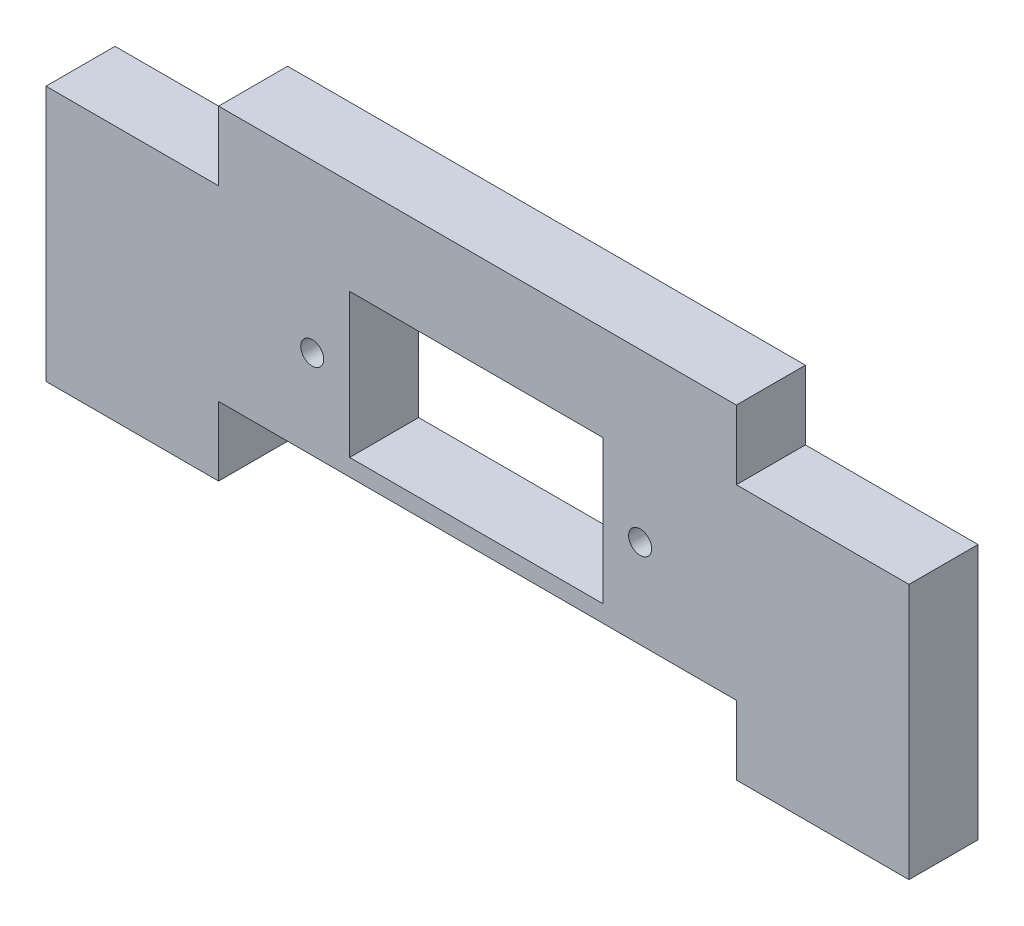
ISO-10303-21;
HEADER;
FILE_DESCRIPTION(('STEP AP214'),'2;1');
FILE_NAME('part.step','',(''),(''),'','','');
FILE_SCHEMA(('AUTOMOTIVE_DESIGN { 1 0 10303 214 1 1 1 1 }'));
ENDSEC;
DATA;
#1=APPLICATION_CONTEXT('core data for automotive mechanical design processes');
#2=APPLICATION_PROTOCOL_DEFINITION('international standard','automotive_design',2000,#1);
#3=PRODUCT_CONTEXT('',#1,'mechanical');
#4=PRODUCT('Part','Part','',(#3));
#5=PRODUCT_RELATED_PRODUCT_CATEGORY('part','',(#4));
#6=PRODUCT_DEFINITION_FORMATION('','',#4);
#7=PRODUCT_DEFINITION_CONTEXT('part definition',#1,'design');
#8=PRODUCT_DEFINITION('design','',#6,#7);
#9=PRODUCT_DEFINITION_SHAPE('','',#8);
#10=(LENGTH_UNIT() NAMED_UNIT(*) SI_UNIT(.MILLI.,.METRE.));
#11=(NAMED_UNIT(*) PLANE_ANGLE_UNIT() SI_UNIT($,.RADIAN.));
#12=(NAMED_UNIT(*) SI_UNIT($,.STERADIAN.) SOLID_ANGLE_UNIT());
#13=UNCERTAINTY_MEASURE_WITH_UNIT(LENGTH_MEASURE(1.E-05),#10,'distance_accuracy_value','');
#14=(GEOMETRIC_REPRESENTATION_CONTEXT(3) GLOBAL_UNCERTAINTY_ASSIGNED_CONTEXT((#13)) GLOBAL_UNIT_ASSIGNED_CONTEXT((#10,
#11,#12)) REPRESENTATION_CONTEXT('',''));
#15=CARTESIAN_POINT('',(0.,0.,0.));
#16=DIRECTION('',(0.,0.,1.));
#17=DIRECTION('',(1.,0.,0.));
#18=AXIS2_PLACEMENT_3D('',#15,#16,#17);
#19=CARTESIAN_POINT('',(-52.2574738828129,114.914823412849,220.248004760979));
#20=DIRECTION('',(0.,1.,0.));
#21=DIRECTION('',(0.,0.,1.));
#22=AXIS2_PLACEMENT_3D('',#19,#20,#21);
#23=PLANE('',#22);
#24=DIRECTION('',(-1.,0.,0.));
#25=VECTOR('',#24,1.);
#26=CARTESIAN_POINT('',(-52.2574738828129,114.914823412849,232.248004760979));
#27=LINE('',#26,#25);
#28=CARTESIAN_POINT('',(-52.2574738828129,114.914823412849,232.248004760979));
#29=VERTEX_POINT('',#28);
#30=CARTESIAN_POINT('',(-82.2574738828129,114.914823412849,232.248004760979));
#31=VERTEX_POINT('',#30);
#32=EDGE_CURVE('E182',#29,#31,#27,.T.);
#33=ORIENTED_EDGE('',*,*,#32,.F.);
#34=DIRECTION('',(0.,0.,1.));
#35=VECTOR('',#34,1.);
#36=CARTESIAN_POINT('',(-52.2574738828129,114.914823412849,220.248004760979));
#37=LINE('',#36,#35);
#38=CARTESIAN_POINT('',(-52.2574738828129,114.914823412849,220.248004760979));
#39=VERTEX_POINT('',#38);
#40=EDGE_CURVE('E11',#39,#29,#37,.T.);
#41=ORIENTED_EDGE('',*,*,#40,.F.);
#42=DIRECTION('',(-1.,0.,0.));
#43=VECTOR('',#42,1.);
#44=CARTESIAN_POINT('',(-52.2574738828129,114.914823412849,220.248004760979));
#45=LINE('',#44,#43);
#46=CARTESIAN_POINT('',(-82.2574738828129,114.914823412849,220.248004760979));
#47=VERTEX_POINT('',#46);
#48=EDGE_CURVE('E186',#39,#47,#45,.T.);
#49=ORIENTED_EDGE('',*,*,#48,.T.);
#50=DIRECTION('',(0.,0.,1.));
#51=VECTOR('',#50,1.);
#52=CARTESIAN_POINT('',(-82.2574738828129,114.914823412849,220.248004760979));
#53=LINE('',#52,#51);
#54=EDGE_CURVE('E220',#47,#31,#53,.T.);
#55=ORIENTED_EDGE('',*,*,#54,.T.);
#56=EDGE_LOOP('',(#33,#41,#49,#55));
#57=FACE_BOUND('',#56,.T.);
#58=ADVANCED_FACE('F33',(#57),#23,.T.);
#59=CARTESIAN_POINT('',(-52.2574738828129,126.914823412849,220.248004760979));
#60=DIRECTION('',(-1.,0.,0.));
#61=DIRECTION('',(0.,0.,1.));
#62=AXIS2_PLACEMENT_3D('',#59,#60,#61);
#63=PLANE('',#62);
#64=DIRECTION('',(0.,-1.,0.));
#65=VECTOR('',#64,1.);
#66=CARTESIAN_POINT('',(-52.2574738828129,126.914823412849,232.248004760979));
#67=LINE('',#66,#65);
#68=CARTESIAN_POINT('',(-52.2574738828129,126.914823412849,232.248004760979));
#69=VERTEX_POINT('',#68);
#70=EDGE_CURVE('E190',#69,#29,#67,.T.);
#71=ORIENTED_EDGE('',*,*,#70,.F.);
#72=DIRECTION('',(0.,0.,1.));
#73=VECTOR('',#72,1.);
#74=CARTESIAN_POINT('',(-52.2574738828129,126.914823412849,220.248004760979));
#75=LINE('',#74,#73);
#76=CARTESIAN_POINT('',(-52.2574738828129,126.914823412849,220.248004760979));
#77=VERTEX_POINT('',#76);
#78=EDGE_CURVE('E41',#77,#69,#75,.T.);
#79=ORIENTED_EDGE('',*,*,#78,.F.);
#80=DIRECTION('',(0.,-1.,0.));
#81=VECTOR('',#80,1.);
#82=CARTESIAN_POINT('',(-52.2574738828129,126.914823412849,220.248004760979));
#83=LINE('',#82,#81);
#84=EDGE_CURVE('E217',#77,#39,#83,.T.);
#85=ORIENTED_EDGE('',*,*,#84,.T.);
#86=ORIENTED_EDGE('',*,*,#40,.T.);
#87=EDGE_LOOP('',(#71,#79,#85,#86));
#88=FACE_BOUND('',#87,.T.);
#89=ADVANCED_FACE('F286',(#88),#63,.T.);
#90=CARTESIAN_POINT('',(-52.2574738828129,126.914823412849,220.248004760979));
#91=DIRECTION('',(0.,1.,0.));
#92=DIRECTION('',(0.,0.,1.));
#93=AXIS2_PLACEMENT_3D('',#90,#91,#92);
#94=PLANE('',#93);
#95=DIRECTION('',(-1.,0.,0.));
#96=VECTOR('',#95,1.);
#97=CARTESIAN_POINT('',(-52.2574738828129,126.914823412849,232.248004760979));
#98=LINE('',#97,#96);
#99=CARTESIAN_POINT('',(37.7425261171871,126.914823412849,232.248004760979));
#100=VERTEX_POINT('',#99);
#101=EDGE_CURVE('E250',#100,#69,#98,.T.);
#102=ORIENTED_EDGE('',*,*,#101,.F.);
#103=DIRECTION('',(0.,0.,1.));
#104=VECTOR('',#103,1.);
#105=CARTESIAN_POINT('',(37.7425261171871,126.914823412849,220.248004760979));
#106=LINE('',#105,#104);
#107=CARTESIAN_POINT('',(37.7425261171871,126.914823412849,220.248004760979));
#108=VERTEX_POINT('',#107);
#109=EDGE_CURVE('E256',#108,#100,#106,.T.);
#110=ORIENTED_EDGE('',*,*,#109,.F.);
#111=DIRECTION('',(-1.,0.,0.));
#112=VECTOR('',#111,1.);
#113=CARTESIAN_POINT('',(-52.2574738828129,126.914823412849,220.248004760979));
#114=LINE('',#113,#112);
#115=EDGE_CURVE('E214',#108,#77,#114,.T.);
#116=ORIENTED_EDGE('',*,*,#115,.T.);
#117=ORIENTED_EDGE('',*,*,#78,.T.);
#118=EDGE_LOOP('',(#102,#110,#116,#117));
#119=FACE_BOUND('',#118,.T.);
#120=ADVANCED_FACE('F324',(#119),#94,.T.);
#121=CARTESIAN_POINT('',(37.7425261171871,126.914823412849,220.248004760979));
#122=DIRECTION('',(1.,0.,0.));
#123=DIRECTION('',(0.,0.,-1.));
#124=AXIS2_PLACEMENT_3D('',#121,#122,#123);
#125=PLANE('',#124);
#126=DIRECTION('',(0.,1.,0.));
#127=VECTOR('',#126,1.);
#128=CARTESIAN_POINT('',(37.7425261171871,126.914823412849,232.248004760979));
#129=LINE('',#128,#127);
#130=CARTESIAN_POINT('',(37.7425261171871,114.914823412849,232.248004760979));
#131=VERTEX_POINT('',#130);
#132=EDGE_CURVE('E247',#131,#100,#129,.T.);
#133=ORIENTED_EDGE('',*,*,#132,.F.);
#134=DIRECTION('',(0.,0.,1.));
#135=VECTOR('',#134,1.);
#136=CARTESIAN_POINT('',(37.7425261171871,114.914823412849,220.248004760979));
#137=LINE('',#136,#135);
#138=CARTESIAN_POINT('',(37.7425261171871,114.914823412849,220.248004760979));
#139=VERTEX_POINT('',#138);
#140=EDGE_CURVE('E258',#139,#131,#137,.T.);
#141=ORIENTED_EDGE('',*,*,#140,.F.);
#142=DIRECTION('',(0.,1.,0.));
#143=VECTOR('',#142,1.);
#144=CARTESIAN_POINT('',(37.7425261171871,126.914823412849,220.248004760979));
#145=LINE('',#144,#143);
#146=EDGE_CURVE('E211',#139,#108,#145,.T.);
#147=ORIENTED_EDGE('',*,*,#146,.T.);
#148=ORIENTED_EDGE('',*,*,#109,.T.);
#149=EDGE_LOOP('',(#133,#141,#147,#148));
#150=FACE_BOUND('',#149,.T.);
#151=ADVANCED_FACE('F322',(#150),#125,.T.);
#152=CARTESIAN_POINT('',(37.7425261171871,114.914823412849,220.248004760979));
#153=DIRECTION('',(0.,1.,0.));
#154=DIRECTION('',(0.,0.,1.));
#155=AXIS2_PLACEMENT_3D('',#152,#153,#154);
#156=PLANE('',#155);
#157=DIRECTION('',(-1.,0.,0.));
#158=VECTOR('',#157,1.);
#159=CARTESIAN_POINT('',(37.7425261171871,114.914823412849,232.248004760979));
#160=LINE('',#159,#158);
#161=CARTESIAN_POINT('',(67.7425261171871,114.914823412849,232.248004760979));
#162=VERTEX_POINT('',#161);
#163=EDGE_CURVE('E244',#162,#131,#160,.T.);
#164=ORIENTED_EDGE('',*,*,#163,.F.);
#165=DIRECTION('',(0.,0.,1.));
#166=VECTOR('',#165,1.);
#167=CARTESIAN_POINT('',(67.7425261171871,114.914823412849,220.248004760979));
#168=LINE('',#167,#166);
#169=CARTESIAN_POINT('',(67.7425261171871,114.914823412849,220.248004760979));
#170=VERTEX_POINT('',#169);
#171=EDGE_CURVE('E260',#170,#162,#168,.T.);
#172=ORIENTED_EDGE('',*,*,#171,.F.);
#173=DIRECTION('',(-1.,0.,0.));
#174=VECTOR('',#173,1.);
#175=CARTESIAN_POINT('',(37.7425261171871,114.914823412849,220.248004760979));
#176=LINE('',#175,#174);
#177=EDGE_CURVE('E208',#170,#139,#176,.T.);
#178=ORIENTED_EDGE('',*,*,#177,.T.);
#179=ORIENTED_EDGE('',*,*,#140,.T.);
#180=EDGE_LOOP('',(#164,#172,#178,#179));
#181=FACE_BOUND('',#180,.T.);
#182=ADVANCED_FACE('F319',(#181),#156,.T.);
#183=CARTESIAN_POINT('',(67.7425261171871,114.914823412849,220.248004760979));
#184=DIRECTION('',(1.,0.,0.));
#185=DIRECTION('',(0.,1.,0.));
#186=AXIS2_PLACEMENT_3D('',#183,#184,#185);
#187=PLANE('',#186);
#188=DIRECTION('',(0.,1.,0.));
#189=VECTOR('',#188,1.);
#190=CARTESIAN_POINT('',(67.7425261171871,114.914823412849,232.248004760979));
#191=LINE('',#190,#189);
#192=CARTESIAN_POINT('',(67.7425261171871,70.4648234128495,232.248004760979));
#193=VERTEX_POINT('',#192);
#194=EDGE_CURVE('E241',#193,#162,#191,.T.);
#195=ORIENTED_EDGE('',*,*,#194,.F.);
#196=DIRECTION('',(0.,0.,1.));
#197=VECTOR('',#196,1.);
#198=CARTESIAN_POINT('',(67.7425261171871,70.4648234128495,220.248004760979));
#199=LINE('',#198,#197);
#200=CARTESIAN_POINT('',(67.7425261171871,70.4648234128495,220.248004760979));
#201=VERTEX_POINT('',#200);
#202=EDGE_CURVE('E262',#201,#193,#199,.T.);
#203=ORIENTED_EDGE('',*,*,#202,.F.);
#204=DIRECTION('',(0.,1.,0.));
#205=VECTOR('',#204,1.);
#206=CARTESIAN_POINT('',(67.7425261171871,82.4648234128495,220.248004760979));
#207=LINE('',#206,#205);
#208=EDGE_CURVE('E206',#201,#170,#207,.T.);
#209=ORIENTED_EDGE('',*,*,#208,.T.);
#210=ORIENTED_EDGE('',*,*,#171,.T.);
#211=EDGE_LOOP('',(#195,#203,#209,#210));
#212=FACE_BOUND('',#211,.T.);
#213=ADVANCED_FACE('F313',(#212),#187,.T.);
#214=CARTESIAN_POINT('',(67.7425261171871,70.4648234128495,220.248004760979));
#215=DIRECTION('',(0.,-1.,0.));
#216=DIRECTION('',(1.,0.,0.));
#217=AXIS2_PLACEMENT_3D('',#214,#215,#216);
#218=PLANE('',#217);
#219=DIRECTION('',(1.,0.,0.));
#220=VECTOR('',#219,1.);
#221=CARTESIAN_POINT('',(67.7425261171871,70.4648234128495,232.248004760979));
#222=LINE('',#221,#220);
#223=CARTESIAN_POINT('',(37.7425261171871,70.4648234128495,232.248004760979));
#224=VERTEX_POINT('',#223);
#225=EDGE_CURVE('E238',#224,#193,#222,.T.);
#226=ORIENTED_EDGE('',*,*,#225,.F.);
#227=DIRECTION('',(0.,0.,1.));
#228=VECTOR('',#227,1.);
#229=CARTESIAN_POINT('',(37.7425261171871,70.4648234128495,220.248004760979));
#230=LINE('',#229,#228);
#231=CARTESIAN_POINT('',(37.7425261171871,70.4648234128495,220.248004760979));
#232=VERTEX_POINT('',#231);
#233=EDGE_CURVE('E265',#232,#224,#230,.T.);
#234=ORIENTED_EDGE('',*,*,#233,.F.);
#235=DIRECTION('',(1.,0.,0.));
#236=VECTOR('',#235,1.);
#237=CARTESIAN_POINT('',(67.7425261171871,70.4648234128495,220.248004760979));
#238=LINE('',#237,#236);
#239=EDGE_CURVE('E203',#232,#201,#238,.T.);
#240=ORIENTED_EDGE('',*,*,#239,.T.);
#241=ORIENTED_EDGE('',*,*,#202,.T.);
#242=EDGE_LOOP('',(#226,#234,#240,#241));
#243=FACE_BOUND('',#242,.T.);
#244=ADVANCED_FACE('F311',(#243),#218,.T.);
#245=CARTESIAN_POINT('',(37.7425261171871,70.4648234128495,220.248004760979));
#246=DIRECTION('',(-1.,0.,0.));
#247=DIRECTION('',(0.,-1.,0.));
#248=AXIS2_PLACEMENT_3D('',#245,#246,#247);
#249=PLANE('',#248);
#250=DIRECTION('',(0.,-1.,0.));
#251=VECTOR('',#250,1.);
#252=CARTESIAN_POINT('',(37.7425261171871,70.4648234128495,232.248004760979));
#253=LINE('',#252,#251);
#254=CARTESIAN_POINT('',(37.7425261171871,82.4648234128495,232.248004760979));
#255=VERTEX_POINT('',#254);
#256=EDGE_CURVE('E235',#255,#224,#253,.T.);
#257=ORIENTED_EDGE('',*,*,#256,.F.);
#258=DIRECTION('',(0.,0.,1.));
#259=VECTOR('',#258,1.);
#260=CARTESIAN_POINT('',(37.7425261171871,82.4648234128495,220.248004760979));
#261=LINE('',#260,#259);
#262=CARTESIAN_POINT('',(37.7425261171871,82.4648234128495,220.248004760979));
#263=VERTEX_POINT('',#262);
#264=EDGE_CURVE('E267',#263,#255,#261,.T.);
#265=ORIENTED_EDGE('',*,*,#264,.F.);
#266=DIRECTION('',(0.,-1.,0.));
#267=VECTOR('',#266,1.);
#268=CARTESIAN_POINT('',(37.7425261171871,70.4648234128495,220.248004760979));
#269=LINE('',#268,#267);
#270=EDGE_CURVE('E200',#263,#232,#269,.T.);
#271=ORIENTED_EDGE('',*,*,#270,.T.);
#272=ORIENTED_EDGE('',*,*,#233,.T.);
#273=EDGE_LOOP('',(#257,#265,#271,#272));
#274=FACE_BOUND('',#273,.T.);
#275=ADVANCED_FACE('F308',(#274),#249,.T.);
#276=CARTESIAN_POINT('',(37.7425261171871,82.4648234128495,220.248004760979));
#277=DIRECTION('',(0.,-1.,0.));
#278=DIRECTION('',(0.,0.,-1.));
#279=AXIS2_PLACEMENT_3D('',#276,#277,#278);
#280=PLANE('',#279);
#281=DIRECTION('',(1.,0.,0.));
#282=VECTOR('',#281,1.);
#283=CARTESIAN_POINT('',(37.7425261171871,82.4648234128495,232.248004760979));
#284=LINE('',#283,#282);
#285=CARTESIAN_POINT('',(-52.2574738828129,82.4648234128495,232.248004760979));
#286=VERTEX_POINT('',#285);
#287=EDGE_CURVE('E232',#286,#255,#284,.T.);
#288=ORIENTED_EDGE('',*,*,#287,.F.);
#289=DIRECTION('',(0.,0.,1.));
#290=VECTOR('',#289,1.);
#291=CARTESIAN_POINT('',(-52.2574738828129,82.4648234128495,220.248004760979));
#292=LINE('',#291,#290);
#293=CARTESIAN_POINT('',(-52.2574738828129,82.4648234128495,220.248004760979));
#294=VERTEX_POINT('',#293);
#295=EDGE_CURVE('E269',#294,#286,#292,.T.);
#296=ORIENTED_EDGE('',*,*,#295,.F.);
#297=DIRECTION('',(1.,0.,0.));
#298=VECTOR('',#297,1.);
#299=CARTESIAN_POINT('',(-52.2574738828129,82.4648234128495,220.248004760979));
#300=LINE('',#299,#298);
#301=EDGE_CURVE('E198',#294,#263,#300,.T.);
#302=ORIENTED_EDGE('',*,*,#301,.T.);
#303=ORIENTED_EDGE('',*,*,#264,.T.);
#304=EDGE_LOOP('',(#288,#296,#302,#303));
#305=FACE_BOUND('',#304,.T.);
#306=ADVANCED_FACE('F301',(#305),#280,.T.);
#307=CARTESIAN_POINT('',(-52.2574738828129,70.4648234128495,220.248004760979));
#308=DIRECTION('',(1.,0.,0.));
#309=DIRECTION('',(0.,1.,0.));
#310=AXIS2_PLACEMENT_3D('',#307,#308,#309);
#311=PLANE('',#310);
#312=DIRECTION('',(0.,1.,0.));
#313=VECTOR('',#312,1.);
#314=CARTESIAN_POINT('',(-52.2574738828129,70.4648234128495,232.248004760979));
#315=LINE('',#314,#313);
#316=CARTESIAN_POINT('',(-52.2574738828129,70.4648234128495,232.248004760979));
#317=VERTEX_POINT('',#316);
#318=EDGE_CURVE('E229',#317,#286,#315,.T.);
#319=ORIENTED_EDGE('',*,*,#318,.F.);
#320=DIRECTION('',(0.,0.,1.));
#321=VECTOR('',#320,1.);
#322=CARTESIAN_POINT('',(-52.2574738828129,70.4648234128495,220.248004760979));
#323=LINE('',#322,#321);
#324=CARTESIAN_POINT('',(-52.2574738828129,70.4648234128495,220.248004760979));
#325=VERTEX_POINT('',#324);
#326=EDGE_CURVE('E272',#325,#317,#323,.T.);
#327=ORIENTED_EDGE('',*,*,#326,.F.);
#328=DIRECTION('',(0.,1.,0.));
#329=VECTOR('',#328,1.);
#330=CARTESIAN_POINT('',(-52.2574738828129,70.4648234128495,220.248004760979));
#331=LINE('',#330,#329);
#332=EDGE_CURVE('E195',#325,#294,#331,.T.);
#333=ORIENTED_EDGE('',*,*,#332,.T.);
#334=ORIENTED_EDGE('',*,*,#295,.T.);
#335=EDGE_LOOP('',(#319,#327,#333,#334));
#336=FACE_BOUND('',#335,.T.);
#337=ADVANCED_FACE('F298',(#336),#311,.T.);
#338=CARTESIAN_POINT('',(-82.2574738828129,70.4648234128495,220.248004760979));
#339=DIRECTION('',(0.,-1.,0.));
#340=DIRECTION('',(1.,0.,0.));
#341=AXIS2_PLACEMENT_3D('',#338,#339,#340);
#342=PLANE('',#341);
#343=DIRECTION('',(1.,0.,0.));
#344=VECTOR('',#343,1.);
#345=CARTESIAN_POINT('',(-82.2574738828129,70.4648234128495,232.248004760979));
#346=LINE('',#345,#344);
#347=CARTESIAN_POINT('',(-82.2574738828129,70.4648234128495,232.248004760979));
#348=VERTEX_POINT('',#347);
#349=EDGE_CURVE('E226',#348,#317,#346,.T.);
#350=ORIENTED_EDGE('',*,*,#349,.F.);
#351=DIRECTION('',(0.,0.,1.));
#352=VECTOR('',#351,1.);
#353=CARTESIAN_POINT('',(-82.2574738828129,70.4648234128495,220.248004760979));
#354=LINE('',#353,#352);
#355=CARTESIAN_POINT('',(-82.2574738828129,70.4648234128495,220.248004760979));
#356=VERTEX_POINT('',#355);
#357=EDGE_CURVE('E274',#356,#348,#354,.T.);
#358=ORIENTED_EDGE('',*,*,#357,.F.);
#359=DIRECTION('',(1.,0.,0.));
#360=VECTOR('',#359,1.);
#361=CARTESIAN_POINT('',(-82.2574738828129,70.4648234128495,220.248004760979));
#362=LINE('',#361,#360);
#363=EDGE_CURVE('E192',#356,#325,#362,.T.);
#364=ORIENTED_EDGE('',*,*,#363,.T.);
#365=ORIENTED_EDGE('',*,*,#326,.T.);
#366=EDGE_LOOP('',(#350,#358,#364,#365));
#367=FACE_BOUND('',#366,.T.);
#368=ADVANCED_FACE('F295',(#367),#342,.T.);
#369=CARTESIAN_POINT('',(-82.2574738828129,82.4648234128495,220.248004760979));
#370=DIRECTION('',(-1.,0.,0.));
#371=DIRECTION('',(0.,0.,1.));
#372=AXIS2_PLACEMENT_3D('',#369,#370,#371);
#373=PLANE('',#372);
#374=DIRECTION('',(0.,-1.,0.));
#375=VECTOR('',#374,1.);
#376=CARTESIAN_POINT('',(-82.2574738828129,82.4648234128495,232.248004760979));
#377=LINE('',#376,#375);
#378=EDGE_CURVE('E223',#31,#348,#377,.T.);
#379=ORIENTED_EDGE('',*,*,#378,.F.);
#380=ORIENTED_EDGE('',*,*,#54,.F.);
#381=DIRECTION('',(0.,-1.,0.));
#382=VECTOR('',#381,1.);
#383=CARTESIAN_POINT('',(-82.2574738828129,114.914823412849,220.248004760979));
#384=LINE('',#383,#382);
#385=EDGE_CURVE('E189',#47,#356,#384,.T.);
#386=ORIENTED_EDGE('',*,*,#385,.T.);
#387=ORIENTED_EDGE('',*,*,#357,.T.);
#388=EDGE_LOOP('',(#379,#380,#386,#387));
#389=FACE_BOUND('',#388,.T.);
#390=ADVANCED_FACE('F292',(#389),#373,.T.);
#391=CARTESIAN_POINT('',(-82.2574738828129,114.914823412849,220.248004760979));
#392=DIRECTION('',(0.,0.,1.));
#393=DIRECTION('',(1.,0.,0.));
#394=AXIS2_PLACEMENT_3D('',#391,#392,#393);
#395=PLANE('',#394);
#396=CARTESIAN_POINT('',(21.0175261171871,97.9148234128494,220.248004760979));
#397=DIRECTION('',(0.,0.,-1.));
#398=DIRECTION('',(-1.,0.,0.));
#399=AXIS2_PLACEMENT_3D('',#396,#397,#398);
#400=CIRCLE('',#399,2.);
#401=CARTESIAN_POINT('',(19.0175261171871,97.9148234128494,220.248004760979));
#402=VERTEX_POINT('',#401);
#403=EDGE_CURVE('E499',#402,#402,#400,.T.);
#404=ORIENTED_EDGE('',*,*,#403,.F.);
#405=EDGE_LOOP('',(#404));
#406=FACE_BOUND('',#405,.T.);
#407=CARTESIAN_POINT('',(-35.9824738828129,97.9148234128494,220.248004760979));
#408=DIRECTION('',(0.,0.,-1.));
#409=DIRECTION('',(-1.,0.,0.));
#410=AXIS2_PLACEMENT_3D('',#407,#408,#409);
#411=CIRCLE('',#410,1.99999999999999);
#412=CARTESIAN_POINT('',(-37.9824738828129,97.9148234128494,220.248004760979));
#413=VERTEX_POINT('',#412);
#414=EDGE_CURVE('E501',#413,#413,#411,.T.);
#415=ORIENTED_EDGE('',*,*,#414,.F.);
#416=EDGE_LOOP('',(#415));
#417=FACE_BOUND('',#416,.T.);
#418=DIRECTION('',(-1.,0.,0.));
#419=VECTOR('',#418,1.);
#420=CARTESIAN_POINT('',(-29.4824738828129,110.414823412849,220.248004760979));
#421=LINE('',#420,#419);
#422=CARTESIAN_POINT('',(14.5175261171871,110.414823412849,220.248004760979));
#423=VERTEX_POINT('',#422);
#424=CARTESIAN_POINT('',(-29.4824738828129,110.414823412849,220.248004760979));
#425=VERTEX_POINT('',#424);
#426=EDGE_CURVE('E154',#423,#425,#421,.T.);
#427=ORIENTED_EDGE('',*,*,#426,.T.);
#428=DIRECTION('',(0.,-1.,0.));
#429=VECTOR('',#428,1.);
#430=CARTESIAN_POINT('',(-29.4824738828129,85.4148234128494,220.248004760979));
#431=LINE('',#430,#429);
#432=CARTESIAN_POINT('',(-29.4824738828129,85.4148234128494,220.248004760979));
#433=VERTEX_POINT('',#432);
#434=EDGE_CURVE('E148',#425,#433,#431,.T.);
#435=ORIENTED_EDGE('',*,*,#434,.T.);
#436=DIRECTION('',(1.,0.,0.));
#437=VECTOR('',#436,1.);
#438=CARTESIAN_POINT('',(-29.4824738828129,85.4148234128494,220.248004760979));
#439=LINE('',#438,#437);
#440=CARTESIAN_POINT('',(14.5175261171871,85.4148234128494,220.248004760979));
#441=VERTEX_POINT('',#440);
#442=EDGE_CURVE('E157',#433,#441,#439,.T.);
#443=ORIENTED_EDGE('',*,*,#442,.T.);
#444=DIRECTION('',(0.,1.,0.));
#445=VECTOR('',#444,1.);
#446=CARTESIAN_POINT('',(14.5175261171871,85.4148234128494,220.248004760979));
#447=LINE('',#446,#445);
#448=EDGE_CURVE('E49',#441,#423,#447,.T.);
#449=ORIENTED_EDGE('',*,*,#448,.T.);
#450=EDGE_LOOP('',(#427,#435,#443,#449));
#451=FACE_BOUND('',#450,.T.);
#452=ORIENTED_EDGE('',*,*,#48,.F.);
#453=ORIENTED_EDGE('',*,*,#84,.F.);
#454=ORIENTED_EDGE('',*,*,#115,.F.);
#455=ORIENTED_EDGE('',*,*,#146,.F.);
#456=ORIENTED_EDGE('',*,*,#177,.F.);
#457=ORIENTED_EDGE('',*,*,#208,.F.);
#458=ORIENTED_EDGE('',*,*,#239,.F.);
#459=ORIENTED_EDGE('',*,*,#270,.F.);
#460=ORIENTED_EDGE('',*,*,#301,.F.);
#461=ORIENTED_EDGE('',*,*,#332,.F.);
#462=ORIENTED_EDGE('',*,*,#363,.F.);
#463=ORIENTED_EDGE('',*,*,#385,.F.);
#464=EDGE_LOOP('',(#452,#453,#454,#455,#456,#457,#458,#459,#460,#461,#462,#463));
#465=FACE_BOUND('',#464,.T.);
#466=ADVANCED_FACE('F161',(#406,#417,#451,#465),#395,.F.);
#467=CARTESIAN_POINT('',(-82.2574738828129,114.914823412849,232.248004760979));
#468=DIRECTION('',(0.,0.,1.));
#469=DIRECTION('',(1.,0.,0.));
#470=AXIS2_PLACEMENT_3D('',#467,#468,#469);
#471=PLANE('',#470);
#472=CARTESIAN_POINT('',(21.0175261171871,97.9148234128494,232.248004760979));
#473=DIRECTION('',(0.,0.,1.));
#474=DIRECTION('',(1.,0.,0.));
#475=AXIS2_PLACEMENT_3D('',#472,#473,#474);
#476=CIRCLE('',#475,2.);
#477=CARTESIAN_POINT('',(23.0175261171871,97.9148234128494,232.248004760979));
#478=VERTEX_POINT('',#477);
#479=EDGE_CURVE('E36',#478,#478,#476,.T.);
#480=ORIENTED_EDGE('',*,*,#479,.F.);
#481=EDGE_LOOP('',(#480));
#482=FACE_BOUND('',#481,.T.);
#483=CARTESIAN_POINT('',(-35.9824738828129,97.9148234128494,232.248004760979));
#484=DIRECTION('',(0.,0.,1.));
#485=DIRECTION('',(1.,0.,0.));
#486=AXIS2_PLACEMENT_3D('',#483,#484,#485);
#487=CIRCLE('',#486,1.99999999999999);
#488=CARTESIAN_POINT('',(-33.9824738828129,97.9148234128494,232.248004760979));
#489=VERTEX_POINT('',#488);
#490=EDGE_CURVE('E170',#489,#489,#487,.T.);
#491=ORIENTED_EDGE('',*,*,#490,.F.);
#492=EDGE_LOOP('',(#491));
#493=FACE_BOUND('',#492,.T.);
#494=DIRECTION('',(0.,-1.,0.));
#495=VECTOR('',#494,1.);
#496=CARTESIAN_POINT('',(-29.4824738828129,85.4148234128494,232.248004760979));
#497=LINE('',#496,#495);
#498=CARTESIAN_POINT('',(-29.4824738828129,110.414823412849,232.248004760979));
#499=VERTEX_POINT('',#498);
#500=CARTESIAN_POINT('',(-29.4824738828129,85.4148234128494,232.248004760979));
#501=VERTEX_POINT('',#500);
#502=EDGE_CURVE('E57',#499,#501,#497,.T.);
#503=ORIENTED_EDGE('',*,*,#502,.F.);
#504=DIRECTION('',(-1.,0.,0.));
#505=VECTOR('',#504,1.);
#506=CARTESIAN_POINT('',(-29.4824738828129,110.414823412849,232.248004760979));
#507=LINE('',#506,#505);
#508=CARTESIAN_POINT('',(14.5175261171871,110.414823412849,232.248004760979));
#509=VERTEX_POINT('',#508);
#510=EDGE_CURVE('E164',#509,#499,#507,.T.);
#511=ORIENTED_EDGE('',*,*,#510,.F.);
#512=DIRECTION('',(0.,1.,0.));
#513=VECTOR('',#512,1.);
#514=CARTESIAN_POINT('',(14.5175261171871,85.4148234128494,232.248004760979));
#515=LINE('',#514,#513);
#516=CARTESIAN_POINT('',(14.5175261171871,85.4148234128494,232.248004760979));
#517=VERTEX_POINT('',#516);
#518=EDGE_CURVE('E167',#517,#509,#515,.T.);
#519=ORIENTED_EDGE('',*,*,#518,.F.);
#520=DIRECTION('',(1.,0.,0.));
#521=VECTOR('',#520,1.);
#522=CARTESIAN_POINT('',(-29.4824738828129,85.4148234128494,232.248004760979));
#523=LINE('',#522,#521);
#524=EDGE_CURVE('E176',#501,#517,#523,.T.);
#525=ORIENTED_EDGE('',*,*,#524,.F.);
#526=EDGE_LOOP('',(#503,#511,#519,#525));
#527=FACE_BOUND('',#526,.T.);
#528=ORIENTED_EDGE('',*,*,#32,.T.);
#529=ORIENTED_EDGE('',*,*,#378,.T.);
#530=ORIENTED_EDGE('',*,*,#349,.T.);
#531=ORIENTED_EDGE('',*,*,#318,.T.);
#532=ORIENTED_EDGE('',*,*,#287,.T.);
#533=ORIENTED_EDGE('',*,*,#256,.T.);
#534=ORIENTED_EDGE('',*,*,#225,.T.);
#535=ORIENTED_EDGE('',*,*,#194,.T.);
#536=ORIENTED_EDGE('',*,*,#163,.T.);
#537=ORIENTED_EDGE('',*,*,#132,.T.);
#538=ORIENTED_EDGE('',*,*,#101,.T.);
#539=ORIENTED_EDGE('',*,*,#70,.T.);
#540=EDGE_LOOP('',(#528,#529,#530,#531,#532,#533,#534,#535,#536,#537,#538,#539));
#541=FACE_BOUND('',#540,.T.);
#542=ADVANCED_FACE('F282',(#482,#493,#527,#541),#471,.T.);
#543=CARTESIAN_POINT('',(-29.4824738828129,85.4148234128494,220.248004760979));
#544=DIRECTION('',(-1.,0.,0.));
#545=DIRECTION('',(0.,-1.,0.));
#546=AXIS2_PLACEMENT_3D('',#543,#544,#545);
#547=PLANE('',#546);
#548=ORIENTED_EDGE('',*,*,#502,.T.);
#549=DIRECTION('',(0.,0.,1.));
#550=VECTOR('',#549,1.);
#551=CARTESIAN_POINT('',(-29.4824738828129,85.4148234128494,220.248004760979));
#552=LINE('',#551,#550);
#553=EDGE_CURVE('E144',#433,#501,#552,.T.);
#554=ORIENTED_EDGE('',*,*,#553,.F.);
#555=ORIENTED_EDGE('',*,*,#434,.F.);
#556=DIRECTION('',(0.,0.,1.));
#557=VECTOR('',#556,1.);
#558=CARTESIAN_POINT('',(-29.4824738828129,110.414823412849,220.248004760979));
#559=LINE('',#558,#557);
#560=EDGE_CURVE('E180',#425,#499,#559,.T.);
#561=ORIENTED_EDGE('',*,*,#560,.T.);
#562=EDGE_LOOP('',(#548,#554,#555,#561));
#563=FACE_BOUND('',#562,.T.);
#564=ADVANCED_FACE('F146',(#563),#547,.F.);
#565=CARTESIAN_POINT('',(-29.4824738828129,110.414823412849,220.248004760979));
#566=DIRECTION('',(0.,1.,0.));
#567=DIRECTION('',(0.,0.,1.));
#568=AXIS2_PLACEMENT_3D('',#565,#566,#567);
#569=PLANE('',#568);
#570=ORIENTED_EDGE('',*,*,#510,.T.);
#571=ORIENTED_EDGE('',*,*,#560,.F.);
#572=ORIENTED_EDGE('',*,*,#426,.F.);
#573=DIRECTION('',(0.,0.,1.));
#574=VECTOR('',#573,1.);
#575=CARTESIAN_POINT('',(14.5175261171871,110.414823412849,220.248004760979));
#576=LINE('',#575,#574);
#577=EDGE_CURVE('E183',#423,#509,#576,.T.);
#578=ORIENTED_EDGE('',*,*,#577,.T.);
#579=EDGE_LOOP('',(#570,#571,#572,#578));
#580=FACE_BOUND('',#579,.T.);
#581=ADVANCED_FACE('F428',(#580),#569,.F.);
#582=CARTESIAN_POINT('',(14.5175261171871,85.4148234128494,220.248004760979));
#583=DIRECTION('',(1.,0.,0.));
#584=DIRECTION('',(0.,0.,-1.));
#585=AXIS2_PLACEMENT_3D('',#582,#583,#584);
#586=PLANE('',#585);
#587=ORIENTED_EDGE('',*,*,#518,.T.);
#588=ORIENTED_EDGE('',*,*,#577,.F.);
#589=ORIENTED_EDGE('',*,*,#448,.F.);
#590=DIRECTION('',(0.,0.,1.));
#591=VECTOR('',#590,1.);
#592=CARTESIAN_POINT('',(14.5175261171871,85.4148234128494,220.248004760979));
#593=LINE('',#592,#591);
#594=EDGE_CURVE('E153',#441,#517,#593,.T.);
#595=ORIENTED_EDGE('',*,*,#594,.T.);
#596=EDGE_LOOP('',(#587,#588,#589,#595));
#597=FACE_BOUND('',#596,.T.);
#598=ADVANCED_FACE('F439',(#597),#586,.F.);
#599=CARTESIAN_POINT('',(-29.4824738828129,85.4148234128494,220.248004760979));
#600=DIRECTION('',(0.,-1.,0.));
#601=DIRECTION('',(0.,0.,-1.));
#602=AXIS2_PLACEMENT_3D('',#599,#600,#601);
#603=PLANE('',#602);
#604=ORIENTED_EDGE('',*,*,#524,.T.);
#605=ORIENTED_EDGE('',*,*,#594,.F.);
#606=ORIENTED_EDGE('',*,*,#442,.F.);
#607=ORIENTED_EDGE('',*,*,#553,.T.);
#608=EDGE_LOOP('',(#604,#605,#606,#607));
#609=FACE_BOUND('',#608,.T.);
#610=ADVANCED_FACE('F158',(#609),#603,.F.);
#611=CARTESIAN_POINT('',(-35.9824738828129,97.9148234128494,220.248004760979));
#612=DIRECTION('',(0.,0.,-1.));
#613=DIRECTION('',(-1.,0.,0.));
#614=AXIS2_PLACEMENT_3D('',#611,#612,#613);
#615=CYLINDRICAL_SURFACE('',#614,1.99999999999999);
#616=ORIENTED_EDGE('',*,*,#490,.T.);
#617=EDGE_LOOP('',(#616));
#618=FACE_BOUND('',#617,.T.);
#619=ORIENTED_EDGE('',*,*,#414,.T.);
#620=EDGE_LOOP('',(#619));
#621=FACE_BOUND('',#620,.T.);
#622=ADVANCED_FACE('F457',(#618,#621),#615,.F.);
#623=CARTESIAN_POINT('',(21.0175261171871,97.9148234128494,220.248004760979));
#624=DIRECTION('',(0.,0.,-1.));
#625=DIRECTION('',(-1.,0.,0.));
#626=AXIS2_PLACEMENT_3D('',#623,#624,#625);
#627=CYLINDRICAL_SURFACE('',#626,2.);
#628=ORIENTED_EDGE('',*,*,#479,.T.);
#629=EDGE_LOOP('',(#628));
#630=FACE_BOUND('',#629,.T.);
#631=ORIENTED_EDGE('',*,*,#403,.T.);
#632=EDGE_LOOP('',(#631));
#633=FACE_BOUND('',#632,.T.);
#634=ADVANCED_FACE('F480',(#630,#633),#627,.F.);
#635=CLOSED_SHELL('',(#58,#89,#120,#151,#182,#213,#244,#275,#306,#337,#368,#390,#466,#542,#564,
#581,#598,#610,#622,#634));
#636=MANIFOLD_SOLID_BREP('B2',#635);
#637=ADVANCED_BREP_SHAPE_REPRESENTATION('',(#18,#636),#14);
#638=SHAPE_DEFINITION_REPRESENTATION(#9,#637);
ENDSEC;
END-ISO-10303-21;
